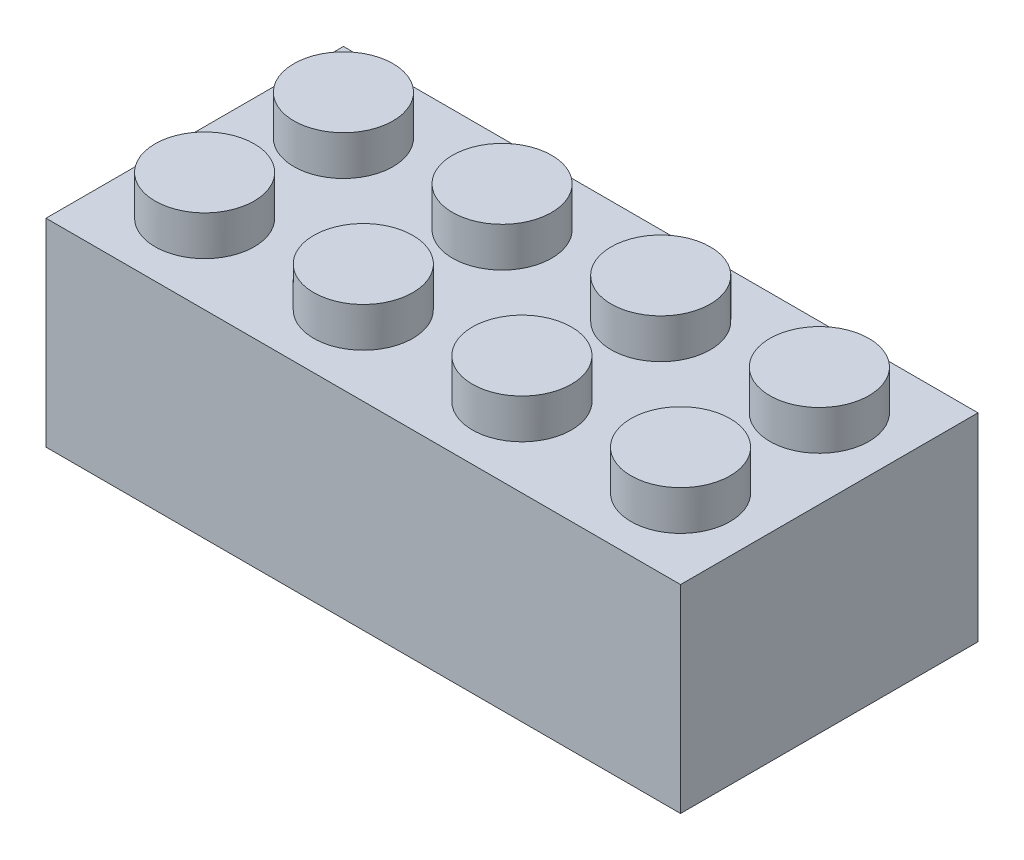
ISO-10303-21;
HEADER;
FILE_DESCRIPTION(('STEP AP214'),'2;1');
FILE_NAME('part.step','',(''),(''),'','','');
FILE_SCHEMA(('AUTOMOTIVE_DESIGN { 1 0 10303 214 1 1 1 1 }'));
ENDSEC;
DATA;
#1=APPLICATION_CONTEXT('core data for automotive mechanical design processes');
#2=APPLICATION_PROTOCOL_DEFINITION('international standard','automotive_design',2000,#1);
#3=PRODUCT_CONTEXT('',#1,'mechanical');
#4=PRODUCT('Part','Part','',(#3));
#5=PRODUCT_RELATED_PRODUCT_CATEGORY('part','',(#4));
#6=PRODUCT_DEFINITION_FORMATION('','',#4);
#7=PRODUCT_DEFINITION_CONTEXT('part definition',#1,'design');
#8=PRODUCT_DEFINITION('design','',#6,#7);
#9=PRODUCT_DEFINITION_SHAPE('','',#8);
#10=(LENGTH_UNIT() NAMED_UNIT(*) SI_UNIT(.MILLI.,.METRE.));
#11=(NAMED_UNIT(*) PLANE_ANGLE_UNIT() SI_UNIT($,.RADIAN.));
#12=(NAMED_UNIT(*) SI_UNIT($,.STERADIAN.) SOLID_ANGLE_UNIT());
#13=UNCERTAINTY_MEASURE_WITH_UNIT(LENGTH_MEASURE(1.E-05),#10,'distance_accuracy_value','');
#14=(GEOMETRIC_REPRESENTATION_CONTEXT(3) GLOBAL_UNCERTAINTY_ASSIGNED_CONTEXT((#13)) GLOBAL_UNIT_ASSIGNED_CONTEXT((#10,
#11,#12)) REPRESENTATION_CONTEXT('',''));
#15=CARTESIAN_POINT('',(0.,0.,0.));
#16=DIRECTION('',(0.,0.,1.));
#17=DIRECTION('',(1.,0.,0.));
#18=AXIS2_PLACEMENT_3D('',#15,#16,#17);
#19=CARTESIAN_POINT('',(0.,9.,0.));
#20=DIRECTION('',(0.,1.,0.));
#21=DIRECTION('',(0.,0.,1.));
#22=AXIS2_PLACEMENT_3D('',#19,#20,#21);
#23=PLANE('',#22);
#24=CARTESIAN_POINT('',(8.,9.,1.1172740284298E-13));
#25=DIRECTION('',(0.,1.,0.));
#26=DIRECTION('',(0.,0.,1.));
#27=AXIS2_PLACEMENT_3D('',#24,#25,#26);
#28=CIRCLE('',#27,3.5);
#29=CARTESIAN_POINT('',(8.,9.,3.50000000000011));
#30=VERTEX_POINT('',#29);
#31=EDGE_CURVE('E12',#30,#30,#28,.F.);
#32=ORIENTED_EDGE('',*,*,#31,.F.);
#33=EDGE_LOOP('',(#32));
#34=FACE_BOUND('',#33,.T.);
#35=DIRECTION('',(0.,0.,1.));
#36=VECTOR('',#35,1.);
#37=CARTESIAN_POINT('',(0.272235441119782,9.,-6.5));
#38=LINE('',#37,#36);
#39=CARTESIAN_POINT('',(0.272235441119782,9.,-6.5));
#40=VERTEX_POINT('',#39);
#41=CARTESIAN_POINT('',(0.272235441119782,9.,-3.48939649002493));
#42=VERTEX_POINT('',#41);
#43=EDGE_CURVE('E190',#40,#42,#38,.T.);
#44=ORIENTED_EDGE('',*,*,#43,.F.);
#45=DIRECTION('',(1.,0.,0.));
#46=VECTOR('',#45,1.);
#47=CARTESIAN_POINT('',(-15.,9.,-6.5));
#48=LINE('',#47,#46);
#49=CARTESIAN_POINT('',(15.,9.,-6.5));
#50=VERTEX_POINT('',#49);
#51=EDGE_CURVE('E207',#40,#50,#48,.T.);
#52=ORIENTED_EDGE('',*,*,#51,.T.);
#53=DIRECTION('',(0.,0.,1.));
#54=VECTOR('',#53,1.);
#55=CARTESIAN_POINT('',(15.,9.,-6.5));
#56=LINE('',#55,#54);
#57=CARTESIAN_POINT('',(15.,9.,6.5));
#58=VERTEX_POINT('',#57);
#59=EDGE_CURVE('E227',#50,#58,#56,.T.);
#60=ORIENTED_EDGE('',*,*,#59,.T.);
#61=DIRECTION('',(-1.,0.,0.));
#62=VECTOR('',#61,1.);
#63=CARTESIAN_POINT('',(-15.,9.,6.5));
#64=LINE('',#63,#62);
#65=CARTESIAN_POINT('',(0.272235441119782,9.,6.5));
#66=VERTEX_POINT('',#65);
#67=EDGE_CURVE('E330',#58,#66,#64,.T.);
#68=ORIENTED_EDGE('',*,*,#67,.T.);
#69=DIRECTION('',(0.,0.,1.));
#70=VECTOR('',#69,1.);
#71=CARTESIAN_POINT('',(0.272235441119782,9.,3.48939649002493));
#72=LINE('',#71,#70);
#73=CARTESIAN_POINT('',(0.272235441119782,9.,3.48939649002493));
#74=VERTEX_POINT('',#73);
#75=EDGE_CURVE('E327',#74,#66,#72,.T.);
#76=ORIENTED_EDGE('',*,*,#75,.F.);
#77=CARTESIAN_POINT('',(0.,9.,0.));
#78=DIRECTION('',(0.,1.,0.));
#79=DIRECTION('',(0.,0.,1.));
#80=AXIS2_PLACEMENT_3D('',#77,#78,#79);
#81=CIRCLE('',#80,3.5);
#82=EDGE_CURVE('E313',#42,#74,#81,.F.);
#83=ORIENTED_EDGE('',*,*,#82,.F.);
#84=EDGE_LOOP('',(#44,#52,#60,#68,#76,#83));
#85=FACE_BOUND('',#84,.T.);
#86=ADVANCED_FACE('F63',(#34,#85),#23,.F.);
#87=CARTESIAN_POINT('',(16.,10.,7.5));
#88=DIRECTION('',(-1.,0.,0.));
#89=DIRECTION('',(0.,0.,1.));
#90=AXIS2_PLACEMENT_3D('',#87,#88,#89);
#91=PLANE('',#90);
#92=DIRECTION('',(0.,0.,-1.));
#93=VECTOR('',#92,1.);
#94=CARTESIAN_POINT('',(16.,0.,7.5));
#95=LINE('',#94,#93);
#96=CARTESIAN_POINT('',(16.,0.,7.5));
#97=VERTEX_POINT('',#96);
#98=CARTESIAN_POINT('',(16.,0.,-7.5));
#99=VERTEX_POINT('',#98);
#100=EDGE_CURVE('E257',#97,#99,#95,.T.);
#101=ORIENTED_EDGE('',*,*,#100,.T.);
#102=DIRECTION('',(0.,-1.,0.));
#103=VECTOR('',#102,1.);
#104=CARTESIAN_POINT('',(16.,10.,-7.5));
#105=LINE('',#104,#103);
#106=CARTESIAN_POINT('',(16.,10.,-7.5));
#107=VERTEX_POINT('',#106);
#108=EDGE_CURVE('E284',#107,#99,#105,.T.);
#109=ORIENTED_EDGE('',*,*,#108,.F.);
#110=DIRECTION('',(0.,0.,-1.));
#111=VECTOR('',#110,1.);
#112=CARTESIAN_POINT('',(16.,10.,7.5));
#113=LINE('',#112,#111);
#114=CARTESIAN_POINT('',(16.,10.,7.5));
#115=VERTEX_POINT('',#114);
#116=EDGE_CURVE('E258',#115,#107,#113,.T.);
#117=ORIENTED_EDGE('',*,*,#116,.F.);
#118=DIRECTION('',(0.,-1.,0.));
#119=VECTOR('',#118,1.);
#120=CARTESIAN_POINT('',(16.,10.,7.5));
#121=LINE('',#120,#119);
#122=EDGE_CURVE('E268',#115,#97,#121,.T.);
#123=ORIENTED_EDGE('',*,*,#122,.T.);
#124=EDGE_LOOP('',(#101,#109,#117,#123));
#125=FACE_BOUND('',#124,.T.);
#126=ADVANCED_FACE('F65',(#125),#91,.F.);
#127=CARTESIAN_POINT('',(-16.,10.,-7.5));
#128=DIRECTION('',(0.,0.,1.));
#129=DIRECTION('',(1.,0.,0.));
#130=AXIS2_PLACEMENT_3D('',#127,#128,#129);
#131=PLANE('',#130);
#132=DIRECTION('',(-1.,0.,0.));
#133=VECTOR('',#132,1.);
#134=CARTESIAN_POINT('',(-16.,0.,-7.5));
#135=LINE('',#134,#133);
#136=CARTESIAN_POINT('',(-16.,0.,-7.5));
#137=VERTEX_POINT('',#136);
#138=EDGE_CURVE('E271',#99,#137,#135,.T.);
#139=ORIENTED_EDGE('',*,*,#138,.T.);
#140=DIRECTION('',(0.,-1.,0.));
#141=VECTOR('',#140,1.);
#142=CARTESIAN_POINT('',(-16.,10.,-7.5));
#143=LINE('',#142,#141);
#144=CARTESIAN_POINT('',(-16.,10.,-7.5));
#145=VERTEX_POINT('',#144);
#146=EDGE_CURVE('E281',#145,#137,#143,.T.);
#147=ORIENTED_EDGE('',*,*,#146,.F.);
#148=DIRECTION('',(-1.,0.,0.));
#149=VECTOR('',#148,1.);
#150=CARTESIAN_POINT('',(-16.,10.,-7.5));
#151=LINE('',#150,#149);
#152=EDGE_CURVE('E261',#107,#145,#151,.T.);
#153=ORIENTED_EDGE('',*,*,#152,.F.);
#154=ORIENTED_EDGE('',*,*,#108,.T.);
#155=EDGE_LOOP('',(#139,#147,#153,#154));
#156=FACE_BOUND('',#155,.T.);
#157=ADVANCED_FACE('F435',(#156),#131,.F.);
#158=CARTESIAN_POINT('',(-16.,10.,7.5));
#159=DIRECTION('',(1.,0.,0.));
#160=DIRECTION('',(0.,0.,-1.));
#161=AXIS2_PLACEMENT_3D('',#158,#159,#160);
#162=PLANE('',#161);
#163=DIRECTION('',(0.,0.,1.));
#164=VECTOR('',#163,1.);
#165=CARTESIAN_POINT('',(-16.,0.,7.5));
#166=LINE('',#165,#164);
#167=CARTESIAN_POINT('',(-16.,0.,7.5));
#168=VERTEX_POINT('',#167);
#169=EDGE_CURVE('E273',#137,#168,#166,.T.);
#170=ORIENTED_EDGE('',*,*,#169,.T.);
#171=DIRECTION('',(0.,-1.,0.));
#172=VECTOR('',#171,1.);
#173=CARTESIAN_POINT('',(-16.,10.,7.5));
#174=LINE('',#173,#172);
#175=CARTESIAN_POINT('',(-16.,10.,7.5));
#176=VERTEX_POINT('',#175);
#177=EDGE_CURVE('E278',#176,#168,#174,.T.);
#178=ORIENTED_EDGE('',*,*,#177,.F.);
#179=DIRECTION('',(0.,0.,1.));
#180=VECTOR('',#179,1.);
#181=CARTESIAN_POINT('',(-16.,10.,7.5));
#182=LINE('',#181,#180);
#183=EDGE_CURVE('E264',#145,#176,#182,.T.);
#184=ORIENTED_EDGE('',*,*,#183,.F.);
#185=ORIENTED_EDGE('',*,*,#146,.T.);
#186=EDGE_LOOP('',(#170,#178,#184,#185));
#187=FACE_BOUND('',#186,.T.);
#188=ADVANCED_FACE('F806',(#187),#162,.F.);
#189=CARTESIAN_POINT('',(-16.,10.,7.5));
#190=DIRECTION('',(0.,0.,-1.));
#191=DIRECTION('',(-1.,0.,0.));
#192=AXIS2_PLACEMENT_3D('',#189,#190,#191);
#193=PLANE('',#192);
#194=DIRECTION('',(1.,0.,0.));
#195=VECTOR('',#194,1.);
#196=CARTESIAN_POINT('',(-16.,0.,7.5));
#197=LINE('',#196,#195);
#198=EDGE_CURVE('E262',#168,#97,#197,.T.);
#199=ORIENTED_EDGE('',*,*,#198,.T.);
#200=ORIENTED_EDGE('',*,*,#122,.F.);
#201=DIRECTION('',(1.,0.,0.));
#202=VECTOR('',#201,1.);
#203=CARTESIAN_POINT('',(-16.,10.,7.5));
#204=LINE('',#203,#202);
#205=EDGE_CURVE('E266',#176,#115,#204,.T.);
#206=ORIENTED_EDGE('',*,*,#205,.F.);
#207=ORIENTED_EDGE('',*,*,#177,.T.);
#208=EDGE_LOOP('',(#199,#200,#206,#207));
#209=FACE_BOUND('',#208,.T.);
#210=ADVANCED_FACE('F797',(#209),#193,.F.);
#211=CARTESIAN_POINT('',(0.,10.,0.));
#212=DIRECTION('',(0.,-1.,0.));
#213=DIRECTION('',(0.,0.,-1.));
#214=AXIS2_PLACEMENT_3D('',#211,#212,#213);
#215=PLANE('',#214);
#216=CARTESIAN_POINT('',(-12.,10.,-3.5));
#217=DIRECTION('',(0.,-1.,0.));
#218=DIRECTION('',(0.,0.,-1.));
#219=AXIS2_PLACEMENT_3D('',#216,#217,#218);
#220=CIRCLE('',#219,2.5);
#221=CARTESIAN_POINT('',(-12.,10.,-6.));
#222=VERTEX_POINT('',#221);
#223=EDGE_CURVE('E308',#222,#222,#220,.F.);
#224=ORIENTED_EDGE('',*,*,#223,.F.);
#225=EDGE_LOOP('',(#224));
#226=FACE_BOUND('',#225,.T.);
#227=CARTESIAN_POINT('',(-4.,10.,-3.5));
#228=DIRECTION('',(0.,-1.,0.));
#229=DIRECTION('',(0.,0.,-1.));
#230=AXIS2_PLACEMENT_3D('',#227,#228,#229);
#231=CIRCLE('',#230,2.5);
#232=CARTESIAN_POINT('',(-4.,10.,-6.));
#233=VERTEX_POINT('',#232);
#234=EDGE_CURVE('E305',#233,#233,#231,.F.);
#235=ORIENTED_EDGE('',*,*,#234,.F.);
#236=EDGE_LOOP('',(#235));
#237=FACE_BOUND('',#236,.T.);
#238=CARTESIAN_POINT('',(4.,10.,-3.5));
#239=DIRECTION('',(0.,-1.,0.));
#240=DIRECTION('',(0.,0.,-1.));
#241=AXIS2_PLACEMENT_3D('',#238,#239,#240);
#242=CIRCLE('',#241,2.5);
#243=CARTESIAN_POINT('',(4.,10.,-6.));
#244=VERTEX_POINT('',#243);
#245=EDGE_CURVE('E302',#244,#244,#242,.F.);
#246=ORIENTED_EDGE('',*,*,#245,.F.);
#247=EDGE_LOOP('',(#246));
#248=FACE_BOUND('',#247,.T.);
#249=CARTESIAN_POINT('',(12.,10.,-3.5));
#250=DIRECTION('',(0.,-1.,0.));
#251=DIRECTION('',(0.,0.,-1.));
#252=AXIS2_PLACEMENT_3D('',#249,#250,#251);
#253=CIRCLE('',#252,2.5);
#254=CARTESIAN_POINT('',(12.,10.,-6.));
#255=VERTEX_POINT('',#254);
#256=EDGE_CURVE('E299',#255,#255,#253,.F.);
#257=ORIENTED_EDGE('',*,*,#256,.F.);
#258=EDGE_LOOP('',(#257));
#259=FACE_BOUND('',#258,.T.);
#260=CARTESIAN_POINT('',(12.,10.,3.5));
#261=DIRECTION('',(0.,-1.,0.));
#262=DIRECTION('',(0.,0.,-1.));
#263=AXIS2_PLACEMENT_3D('',#260,#261,#262);
#264=CIRCLE('',#263,2.5);
#265=CARTESIAN_POINT('',(12.,10.,0.999999999999998));
#266=VERTEX_POINT('',#265);
#267=EDGE_CURVE('E296',#266,#266,#264,.F.);
#268=ORIENTED_EDGE('',*,*,#267,.F.);
#269=EDGE_LOOP('',(#268));
#270=FACE_BOUND('',#269,.T.);
#271=CARTESIAN_POINT('',(4.,10.,3.5));
#272=DIRECTION('',(0.,-1.,0.));
#273=DIRECTION('',(0.,0.,-1.));
#274=AXIS2_PLACEMENT_3D('',#271,#272,#273);
#275=CIRCLE('',#274,2.5);
#276=CARTESIAN_POINT('',(4.,10.,0.999999999999998));
#277=VERTEX_POINT('',#276);
#278=EDGE_CURVE('E293',#277,#277,#275,.F.);
#279=ORIENTED_EDGE('',*,*,#278,.F.);
#280=EDGE_LOOP('',(#279));
#281=FACE_BOUND('',#280,.T.);
#282=CARTESIAN_POINT('',(-4.,10.,3.5));
#283=DIRECTION('',(0.,-1.,0.));
#284=DIRECTION('',(0.,0.,-1.));
#285=AXIS2_PLACEMENT_3D('',#282,#283,#284);
#286=CIRCLE('',#285,2.5);
#287=CARTESIAN_POINT('',(-4.,10.,0.999999999999998));
#288=VERTEX_POINT('',#287);
#289=EDGE_CURVE('E290',#288,#288,#286,.F.);
#290=ORIENTED_EDGE('',*,*,#289,.F.);
#291=EDGE_LOOP('',(#290));
#292=FACE_BOUND('',#291,.T.);
#293=CARTESIAN_POINT('',(-12.,10.,3.5));
#294=DIRECTION('',(0.,-1.,0.));
#295=DIRECTION('',(0.,0.,-1.));
#296=AXIS2_PLACEMENT_3D('',#293,#294,#295);
#297=CIRCLE('',#296,2.5);
#298=CARTESIAN_POINT('',(-12.,10.,0.999999999999998));
#299=VERTEX_POINT('',#298);
#300=EDGE_CURVE('E287',#299,#299,#297,.F.);
#301=ORIENTED_EDGE('',*,*,#300,.F.);
#302=EDGE_LOOP('',(#301));
#303=FACE_BOUND('',#302,.T.);
#304=ORIENTED_EDGE('',*,*,#116,.T.);
#305=ORIENTED_EDGE('',*,*,#152,.T.);
#306=ORIENTED_EDGE('',*,*,#183,.T.);
#307=ORIENTED_EDGE('',*,*,#205,.T.);
#308=EDGE_LOOP('',(#304,#305,#306,#307));
#309=FACE_BOUND('',#308,.T.);
#310=ADVANCED_FACE('F789',(#226,#237,#248,#259,#270,#281,#292,#303,#309),#215,.F.);
#311=CARTESIAN_POINT('',(0.,0.,0.));
#312=DIRECTION('',(0.,-1.,0.));
#313=DIRECTION('',(0.,0.,-1.));
#314=AXIS2_PLACEMENT_3D('',#311,#312,#313);
#315=PLANE('',#314);
#316=DIRECTION('',(0.,0.,1.));
#317=VECTOR('',#316,1.);
#318=CARTESIAN_POINT('',(15.,0.,-6.5));
#319=LINE('',#318,#317);
#320=CARTESIAN_POINT('',(15.,0.,-6.5));
#321=VERTEX_POINT('',#320);
#322=CARTESIAN_POINT('',(15.,0.,6.5));
#323=VERTEX_POINT('',#322);
#324=EDGE_CURVE('E215',#321,#323,#319,.T.);
#325=ORIENTED_EDGE('',*,*,#324,.F.);
#326=DIRECTION('',(1.,0.,0.));
#327=VECTOR('',#326,1.);
#328=CARTESIAN_POINT('',(-15.,0.,-6.5));
#329=LINE('',#328,#327);
#330=CARTESIAN_POINT('',(-15.,0.,-6.5));
#331=VERTEX_POINT('',#330);
#332=EDGE_CURVE('E224',#331,#321,#329,.T.);
#333=ORIENTED_EDGE('',*,*,#332,.F.);
#334=DIRECTION('',(0.,0.,-1.));
#335=VECTOR('',#334,1.);
#336=CARTESIAN_POINT('',(-15.,0.,-6.5));
#337=LINE('',#336,#335);
#338=CARTESIAN_POINT('',(-15.,0.,6.5));
#339=VERTEX_POINT('',#338);
#340=EDGE_CURVE('E221',#339,#331,#337,.T.);
#341=ORIENTED_EDGE('',*,*,#340,.F.);
#342=DIRECTION('',(-1.,0.,0.));
#343=VECTOR('',#342,1.);
#344=CARTESIAN_POINT('',(-15.,0.,6.5));
#345=LINE('',#344,#343);
#346=EDGE_CURVE('E217',#323,#339,#345,.T.);
#347=ORIENTED_EDGE('',*,*,#346,.F.);
#348=EDGE_LOOP('',(#325,#333,#341,#347));
#349=FACE_BOUND('',#348,.T.);
#350=ORIENTED_EDGE('',*,*,#100,.F.);
#351=ORIENTED_EDGE('',*,*,#198,.F.);
#352=ORIENTED_EDGE('',*,*,#169,.F.);
#353=ORIENTED_EDGE('',*,*,#138,.F.);
#354=EDGE_LOOP('',(#350,#351,#352,#353));
#355=FACE_BOUND('',#354,.T.);
#356=ADVANCED_FACE('F387',(#349,#355),#315,.T.);
#357=CARTESIAN_POINT('',(-12.,12.,3.5));
#358=DIRECTION('',(0.,-1.,0.));
#359=DIRECTION('',(0.,0.,-1.));
#360=AXIS2_PLACEMENT_3D('',#357,#358,#359);
#361=CYLINDRICAL_SURFACE('',#360,2.5);
#362=CARTESIAN_POINT('',(-12.,12.,3.5));
#363=DIRECTION('',(0.,1.,0.));
#364=DIRECTION('',(0.,0.,1.));
#365=AXIS2_PLACEMENT_3D('',#362,#363,#364);
#366=CIRCLE('',#365,2.5);
#367=CARTESIAN_POINT('',(-12.,12.,6.));
#368=VERTEX_POINT('',#367);
#369=EDGE_CURVE('E254',#368,#368,#366,.T.);
#370=ORIENTED_EDGE('',*,*,#369,.F.);
#371=EDGE_LOOP('',(#370));
#372=FACE_BOUND('',#371,.T.);
#373=ORIENTED_EDGE('',*,*,#300,.T.);
#374=EDGE_LOOP('',(#373));
#375=FACE_BOUND('',#374,.T.);
#376=ADVANCED_FACE('F772',(#372,#375),#361,.T.);
#377=CARTESIAN_POINT('',(-12.,12.,3.5));
#378=DIRECTION('',(0.,1.,0.));
#379=DIRECTION('',(0.,0.,1.));
#380=AXIS2_PLACEMENT_3D('',#377,#378,#379);
#381=PLANE('',#380);
#382=ORIENTED_EDGE('',*,*,#369,.T.);
#383=EDGE_LOOP('',(#382));
#384=FACE_BOUND('',#383,.T.);
#385=ADVANCED_FACE('F763',(#384),#381,.T.);
#386=CARTESIAN_POINT('',(-4.,12.,3.5));
#387=DIRECTION('',(0.,-1.,0.));
#388=DIRECTION('',(0.,0.,-1.));
#389=AXIS2_PLACEMENT_3D('',#386,#387,#388);
#390=CYLINDRICAL_SURFACE('',#389,2.5);
#391=CARTESIAN_POINT('',(-4.,12.,3.5));
#392=DIRECTION('',(0.,1.,0.));
#393=DIRECTION('',(0.,0.,1.));
#394=AXIS2_PLACEMENT_3D('',#391,#392,#393);
#395=CIRCLE('',#394,2.5);
#396=CARTESIAN_POINT('',(-4.,12.,6.));
#397=VERTEX_POINT('',#396);
#398=EDGE_CURVE('E251',#397,#397,#395,.T.);
#399=ORIENTED_EDGE('',*,*,#398,.F.);
#400=EDGE_LOOP('',(#399));
#401=FACE_BOUND('',#400,.T.);
#402=ORIENTED_EDGE('',*,*,#289,.T.);
#403=EDGE_LOOP('',(#402));
#404=FACE_BOUND('',#403,.T.);
#405=ADVANCED_FACE('F754',(#401,#404),#390,.T.);
#406=CARTESIAN_POINT('',(-4.,12.,3.5));
#407=DIRECTION('',(0.,1.,0.));
#408=DIRECTION('',(0.,0.,1.));
#409=AXIS2_PLACEMENT_3D('',#406,#407,#408);
#410=PLANE('',#409);
#411=ORIENTED_EDGE('',*,*,#398,.T.);
#412=EDGE_LOOP('',(#411));
#413=FACE_BOUND('',#412,.T.);
#414=ADVANCED_FACE('F745',(#413),#410,.T.);
#415=CARTESIAN_POINT('',(4.,12.,3.5));
#416=DIRECTION('',(0.,-1.,0.));
#417=DIRECTION('',(0.,0.,-1.));
#418=AXIS2_PLACEMENT_3D('',#415,#416,#417);
#419=CYLINDRICAL_SURFACE('',#418,2.5);
#420=CARTESIAN_POINT('',(4.,12.,3.5));
#421=DIRECTION('',(0.,1.,0.));
#422=DIRECTION('',(0.,0.,1.));
#423=AXIS2_PLACEMENT_3D('',#420,#421,#422);
#424=CIRCLE('',#423,2.5);
#425=CARTESIAN_POINT('',(4.,12.,6.));
#426=VERTEX_POINT('',#425);
#427=EDGE_CURVE('E248',#426,#426,#424,.T.);
#428=ORIENTED_EDGE('',*,*,#427,.F.);
#429=EDGE_LOOP('',(#428));
#430=FACE_BOUND('',#429,.T.);
#431=ORIENTED_EDGE('',*,*,#278,.T.);
#432=EDGE_LOOP('',(#431));
#433=FACE_BOUND('',#432,.T.);
#434=ADVANCED_FACE('F736',(#430,#433),#419,.T.);
#435=CARTESIAN_POINT('',(4.,12.,3.5));
#436=DIRECTION('',(0.,1.,0.));
#437=DIRECTION('',(0.,0.,1.));
#438=AXIS2_PLACEMENT_3D('',#435,#436,#437);
#439=PLANE('',#438);
#440=ORIENTED_EDGE('',*,*,#427,.T.);
#441=EDGE_LOOP('',(#440));
#442=FACE_BOUND('',#441,.T.);
#443=ADVANCED_FACE('F727',(#442),#439,.T.);
#444=CARTESIAN_POINT('',(12.,12.,3.5));
#445=DIRECTION('',(0.,-1.,0.));
#446=DIRECTION('',(0.,0.,-1.));
#447=AXIS2_PLACEMENT_3D('',#444,#445,#446);
#448=CYLINDRICAL_SURFACE('',#447,2.5);
#449=CARTESIAN_POINT('',(12.,12.,3.5));
#450=DIRECTION('',(0.,1.,0.));
#451=DIRECTION('',(0.,0.,1.));
#452=AXIS2_PLACEMENT_3D('',#449,#450,#451);
#453=CIRCLE('',#452,2.5);
#454=CARTESIAN_POINT('',(12.,12.,6.));
#455=VERTEX_POINT('',#454);
#456=EDGE_CURVE('E245',#455,#455,#453,.T.);
#457=ORIENTED_EDGE('',*,*,#456,.F.);
#458=EDGE_LOOP('',(#457));
#459=FACE_BOUND('',#458,.T.);
#460=ORIENTED_EDGE('',*,*,#267,.T.);
#461=EDGE_LOOP('',(#460));
#462=FACE_BOUND('',#461,.T.);
#463=ADVANCED_FACE('F718',(#459,#462),#448,.T.);
#464=CARTESIAN_POINT('',(12.,12.,3.5));
#465=DIRECTION('',(0.,1.,0.));
#466=DIRECTION('',(0.,0.,1.));
#467=AXIS2_PLACEMENT_3D('',#464,#465,#466);
#468=PLANE('',#467);
#469=ORIENTED_EDGE('',*,*,#456,.T.);
#470=EDGE_LOOP('',(#469));
#471=FACE_BOUND('',#470,.T.);
#472=ADVANCED_FACE('F709',(#471),#468,.T.);
#473=CARTESIAN_POINT('',(12.,12.,-3.5));
#474=DIRECTION('',(0.,-1.,0.));
#475=DIRECTION('',(0.,0.,-1.));
#476=AXIS2_PLACEMENT_3D('',#473,#474,#475);
#477=CYLINDRICAL_SURFACE('',#476,2.5);
#478=CARTESIAN_POINT('',(12.,12.,-3.5));
#479=DIRECTION('',(0.,1.,0.));
#480=DIRECTION('',(0.,0.,-1.));
#481=AXIS2_PLACEMENT_3D('',#478,#479,#480);
#482=CIRCLE('',#481,2.5);
#483=CARTESIAN_POINT('',(12.,12.,-6.));
#484=VERTEX_POINT('',#483);
#485=EDGE_CURVE('E242',#484,#484,#482,.T.);
#486=ORIENTED_EDGE('',*,*,#485,.F.);
#487=EDGE_LOOP('',(#486));
#488=FACE_BOUND('',#487,.T.);
#489=ORIENTED_EDGE('',*,*,#256,.T.);
#490=EDGE_LOOP('',(#489));
#491=FACE_BOUND('',#490,.T.);
#492=ADVANCED_FACE('F700',(#488,#491),#477,.T.);
#493=CARTESIAN_POINT('',(12.,12.,-3.5));
#494=DIRECTION('',(0.,-1.,0.));
#495=DIRECTION('',(0.,0.,-1.));
#496=AXIS2_PLACEMENT_3D('',#493,#494,#495);
#497=PLANE('',#496);
#498=ORIENTED_EDGE('',*,*,#485,.T.);
#499=EDGE_LOOP('',(#498));
#500=FACE_BOUND('',#499,.T.);
#501=ADVANCED_FACE('F691',(#500),#497,.F.);
#502=CARTESIAN_POINT('',(4.,12.,-3.5));
#503=DIRECTION('',(0.,-1.,0.));
#504=DIRECTION('',(0.,0.,-1.));
#505=AXIS2_PLACEMENT_3D('',#502,#503,#504);
#506=CYLINDRICAL_SURFACE('',#505,2.5);
#507=CARTESIAN_POINT('',(4.,12.,-3.5));
#508=DIRECTION('',(0.,1.,0.));
#509=DIRECTION('',(0.,0.,-1.));
#510=AXIS2_PLACEMENT_3D('',#507,#508,#509);
#511=CIRCLE('',#510,2.5);
#512=CARTESIAN_POINT('',(4.,12.,-6.));
#513=VERTEX_POINT('',#512);
#514=EDGE_CURVE('E239',#513,#513,#511,.T.);
#515=ORIENTED_EDGE('',*,*,#514,.F.);
#516=EDGE_LOOP('',(#515));
#517=FACE_BOUND('',#516,.T.);
#518=ORIENTED_EDGE('',*,*,#245,.T.);
#519=EDGE_LOOP('',(#518));
#520=FACE_BOUND('',#519,.T.);
#521=ADVANCED_FACE('F682',(#517,#520),#506,.T.);
#522=CARTESIAN_POINT('',(4.,12.,-3.5));
#523=DIRECTION('',(0.,-1.,0.));
#524=DIRECTION('',(0.,0.,-1.));
#525=AXIS2_PLACEMENT_3D('',#522,#523,#524);
#526=PLANE('',#525);
#527=ORIENTED_EDGE('',*,*,#514,.T.);
#528=EDGE_LOOP('',(#527));
#529=FACE_BOUND('',#528,.T.);
#530=ADVANCED_FACE('F673',(#529),#526,.F.);
#531=CARTESIAN_POINT('',(-4.,12.,-3.5));
#532=DIRECTION('',(0.,-1.,0.));
#533=DIRECTION('',(0.,0.,-1.));
#534=AXIS2_PLACEMENT_3D('',#531,#532,#533);
#535=CYLINDRICAL_SURFACE('',#534,2.5);
#536=CARTESIAN_POINT('',(-4.,12.,-3.5));
#537=DIRECTION('',(0.,1.,0.));
#538=DIRECTION('',(0.,0.,-1.));
#539=AXIS2_PLACEMENT_3D('',#536,#537,#538);
#540=CIRCLE('',#539,2.5);
#541=CARTESIAN_POINT('',(-4.,12.,-6.));
#542=VERTEX_POINT('',#541);
#543=EDGE_CURVE('E236',#542,#542,#540,.T.);
#544=ORIENTED_EDGE('',*,*,#543,.F.);
#545=EDGE_LOOP('',(#544));
#546=FACE_BOUND('',#545,.T.);
#547=ORIENTED_EDGE('',*,*,#234,.T.);
#548=EDGE_LOOP('',(#547));
#549=FACE_BOUND('',#548,.T.);
#550=ADVANCED_FACE('F664',(#546,#549),#535,.T.);
#551=CARTESIAN_POINT('',(-4.,12.,-3.5));
#552=DIRECTION('',(0.,-1.,0.));
#553=DIRECTION('',(0.,0.,-1.));
#554=AXIS2_PLACEMENT_3D('',#551,#552,#553);
#555=PLANE('',#554);
#556=ORIENTED_EDGE('',*,*,#543,.T.);
#557=EDGE_LOOP('',(#556));
#558=FACE_BOUND('',#557,.T.);
#559=ADVANCED_FACE('F655',(#558),#555,.F.);
#560=CARTESIAN_POINT('',(-12.,12.,-3.5));
#561=DIRECTION('',(0.,-1.,0.));
#562=DIRECTION('',(0.,0.,-1.));
#563=AXIS2_PLACEMENT_3D('',#560,#561,#562);
#564=CYLINDRICAL_SURFACE('',#563,2.5);
#565=CARTESIAN_POINT('',(-12.,12.,-3.5));
#566=DIRECTION('',(0.,1.,0.));
#567=DIRECTION('',(0.,0.,-1.));
#568=AXIS2_PLACEMENT_3D('',#565,#566,#567);
#569=CIRCLE('',#568,2.5);
#570=CARTESIAN_POINT('',(-12.,12.,-6.));
#571=VERTEX_POINT('',#570);
#572=EDGE_CURVE('E230',#571,#571,#569,.T.);
#573=ORIENTED_EDGE('',*,*,#572,.F.);
#574=EDGE_LOOP('',(#573));
#575=FACE_BOUND('',#574,.T.);
#576=ORIENTED_EDGE('',*,*,#223,.T.);
#577=EDGE_LOOP('',(#576));
#578=FACE_BOUND('',#577,.T.);
#579=ADVANCED_FACE('F646',(#575,#578),#564,.T.);
#580=CARTESIAN_POINT('',(-12.,12.,-3.5));
#581=DIRECTION('',(0.,-1.,0.));
#582=DIRECTION('',(0.,0.,-1.));
#583=AXIS2_PLACEMENT_3D('',#580,#581,#582);
#584=PLANE('',#583);
#585=ORIENTED_EDGE('',*,*,#572,.T.);
#586=EDGE_LOOP('',(#585));
#587=FACE_BOUND('',#586,.T.);
#588=ADVANCED_FACE('F638',(#587),#584,.F.);
#589=CARTESIAN_POINT('',(15.,9.,-6.5));
#590=DIRECTION('',(1.,0.,0.));
#591=DIRECTION('',(0.,0.,-1.));
#592=AXIS2_PLACEMENT_3D('',#589,#590,#591);
#593=PLANE('',#592);
#594=ORIENTED_EDGE('',*,*,#324,.T.);
#595=DIRECTION('',(0.,-1.,0.));
#596=VECTOR('',#595,1.);
#597=CARTESIAN_POINT('',(15.,9.,6.5));
#598=LINE('',#597,#596);
#599=EDGE_CURVE('E206',#58,#323,#598,.T.);
#600=ORIENTED_EDGE('',*,*,#599,.F.);
#601=ORIENTED_EDGE('',*,*,#59,.F.);
#602=DIRECTION('',(0.,-1.,0.));
#603=VECTOR('',#602,1.);
#604=CARTESIAN_POINT('',(15.,9.,-6.5));
#605=LINE('',#604,#603);
#606=EDGE_CURVE('E228',#50,#321,#605,.T.);
#607=ORIENTED_EDGE('',*,*,#606,.T.);
#608=EDGE_LOOP('',(#594,#600,#601,#607));
#609=FACE_BOUND('',#608,.T.);
#610=ADVANCED_FACE('F390',(#609),#593,.F.);
#611=CARTESIAN_POINT('',(-15.,9.,-6.5));
#612=DIRECTION('',(0.,0.,-1.));
#613=DIRECTION('',(-1.,0.,0.));
#614=AXIS2_PLACEMENT_3D('',#611,#612,#613);
#615=PLANE('',#614);
#616=DIRECTION('',(1.,0.,0.));
#617=VECTOR('',#616,1.);
#618=CARTESIAN_POINT('',(-0.272235441119782,2.,-6.5));
#619=LINE('',#618,#617);
#620=CARTESIAN_POINT('',(-0.272235441119782,2.,-6.5));
#621=VERTEX_POINT('',#620);
#622=CARTESIAN_POINT('',(0.272235441119782,2.,-6.5));
#623=VERTEX_POINT('',#622);
#624=EDGE_CURVE('E198',#621,#623,#619,.T.);
#625=ORIENTED_EDGE('',*,*,#624,.F.);
#626=DIRECTION('',(0.,1.,0.));
#627=VECTOR('',#626,1.);
#628=CARTESIAN_POINT('',(-0.272235441119782,2.,-6.5));
#629=LINE('',#628,#627);
#630=CARTESIAN_POINT('',(-0.272235441119782,9.,-6.5));
#631=VERTEX_POINT('',#630);
#632=EDGE_CURVE('E181',#621,#631,#629,.T.);
#633=ORIENTED_EDGE('',*,*,#632,.T.);
#634=CARTESIAN_POINT('',(-15.,9.,-6.5));
#635=VERTEX_POINT('',#634);
#636=EDGE_CURVE('E196',#635,#631,#48,.T.);
#637=ORIENTED_EDGE('',*,*,#636,.F.);
#638=DIRECTION('',(0.,-1.,0.));
#639=VECTOR('',#638,1.);
#640=CARTESIAN_POINT('',(-15.,9.,-6.5));
#641=LINE('',#640,#639);
#642=EDGE_CURVE('E231',#635,#331,#641,.T.);
#643=ORIENTED_EDGE('',*,*,#642,.T.);
#644=ORIENTED_EDGE('',*,*,#332,.T.);
#645=ORIENTED_EDGE('',*,*,#606,.F.);
#646=ORIENTED_EDGE('',*,*,#51,.F.);
#647=DIRECTION('',(0.,1.,0.));
#648=VECTOR('',#647,1.);
#649=CARTESIAN_POINT('',(0.272235441119782,2.,-6.5));
#650=LINE('',#649,#648);
#651=EDGE_CURVE('E199',#623,#40,#650,.T.);
#652=ORIENTED_EDGE('',*,*,#651,.F.);
#653=EDGE_LOOP('',(#625,#633,#637,#643,#644,#645,#646,#652));
#654=FACE_BOUND('',#653,.T.);
#655=ADVANCED_FACE('F195',(#654),#615,.F.);
#656=CARTESIAN_POINT('',(-15.,9.,-6.5));
#657=DIRECTION('',(-1.,0.,0.));
#658=DIRECTION('',(0.,0.,1.));
#659=AXIS2_PLACEMENT_3D('',#656,#657,#658);
#660=PLANE('',#659);
#661=ORIENTED_EDGE('',*,*,#340,.T.);
#662=ORIENTED_EDGE('',*,*,#642,.F.);
#663=DIRECTION('',(0.,0.,-1.));
#664=VECTOR('',#663,1.);
#665=CARTESIAN_POINT('',(-15.,9.,-6.5));
#666=LINE('',#665,#664);
#667=CARTESIAN_POINT('',(-15.,9.,6.5));
#668=VERTEX_POINT('',#667);
#669=EDGE_CURVE('E205',#668,#635,#666,.T.);
#670=ORIENTED_EDGE('',*,*,#669,.F.);
#671=DIRECTION('',(0.,-1.,0.));
#672=VECTOR('',#671,1.);
#673=CARTESIAN_POINT('',(-15.,9.,6.5));
#674=LINE('',#673,#672);
#675=EDGE_CURVE('E210',#668,#339,#674,.T.);
#676=ORIENTED_EDGE('',*,*,#675,.T.);
#677=EDGE_LOOP('',(#661,#662,#670,#676));
#678=FACE_BOUND('',#677,.T.);
#679=ADVANCED_FACE('F380',(#678),#660,.F.);
#680=CARTESIAN_POINT('',(-15.,9.,6.5));
#681=DIRECTION('',(0.,0.,1.));
#682=DIRECTION('',(1.,0.,0.));
#683=AXIS2_PLACEMENT_3D('',#680,#681,#682);
#684=PLANE('',#683);
#685=CARTESIAN_POINT('',(-0.272235441119782,9.,6.5));
#686=VERTEX_POINT('',#685);
#687=EDGE_CURVE('E373',#686,#668,#64,.T.);
#688=ORIENTED_EDGE('',*,*,#687,.F.);
#689=DIRECTION('',(0.,1.,0.));
#690=VECTOR('',#689,1.);
#691=CARTESIAN_POINT('',(-0.272235441119782,2.,6.5));
#692=LINE('',#691,#690);
#693=CARTESIAN_POINT('',(-0.272235441119784,2.,6.5));
#694=VERTEX_POINT('',#693);
#695=EDGE_CURVE('E86',#694,#686,#692,.T.);
#696=ORIENTED_EDGE('',*,*,#695,.F.);
#697=DIRECTION('',(1.,0.,0.));
#698=VECTOR('',#697,1.);
#699=CARTESIAN_POINT('',(-0.272235441119782,2.,6.5));
#700=LINE('',#699,#698);
#701=CARTESIAN_POINT('',(0.272235441119782,2.,6.5));
#702=VERTEX_POINT('',#701);
#703=EDGE_CURVE('E405',#694,#702,#700,.T.);
#704=ORIENTED_EDGE('',*,*,#703,.T.);
#705=DIRECTION('',(0.,1.,0.));
#706=VECTOR('',#705,1.);
#707=CARTESIAN_POINT('',(0.272235441119782,2.,6.5));
#708=LINE('',#707,#706);
#709=EDGE_CURVE('E340',#702,#66,#708,.T.);
#710=ORIENTED_EDGE('',*,*,#709,.T.);
#711=ORIENTED_EDGE('',*,*,#67,.F.);
#712=ORIENTED_EDGE('',*,*,#599,.T.);
#713=ORIENTED_EDGE('',*,*,#346,.T.);
#714=ORIENTED_EDGE('',*,*,#675,.F.);
#715=EDGE_LOOP('',(#688,#696,#704,#710,#711,#712,#713,#714));
#716=FACE_BOUND('',#715,.T.);
#717=ADVANCED_FACE('F376',(#716),#684,.F.);
#718=ORIENTED_EDGE('',*,*,#636,.T.);
#719=DIRECTION('',(0.,0.,1.));
#720=VECTOR('',#719,1.);
#721=CARTESIAN_POINT('',(-0.272235441119782,9.,-6.5));
#722=LINE('',#721,#720);
#723=CARTESIAN_POINT('',(-0.272235441119782,9.,-3.48939649002493));
#724=VERTEX_POINT('',#723);
#725=EDGE_CURVE('E177',#631,#724,#722,.T.);
#726=ORIENTED_EDGE('',*,*,#725,.T.);
#727=CARTESIAN_POINT('',(-0.272235441119782,9.,3.48939649002493));
#728=VERTEX_POINT('',#727);
#729=EDGE_CURVE('E71',#728,#724,#81,.F.);
#730=ORIENTED_EDGE('',*,*,#729,.F.);
#731=DIRECTION('',(0.,0.,1.));
#732=VECTOR('',#731,1.);
#733=CARTESIAN_POINT('',(-0.272235441119782,9.,3.48939649002493));
#734=LINE('',#733,#732);
#735=EDGE_CURVE('E189',#728,#686,#734,.T.);
#736=ORIENTED_EDGE('',*,*,#735,.T.);
#737=ORIENTED_EDGE('',*,*,#687,.T.);
#738=ORIENTED_EDGE('',*,*,#669,.T.);
#739=EDGE_LOOP('',(#718,#726,#730,#736,#737,#738));
#740=FACE_BOUND('',#739,.T.);
#741=CARTESIAN_POINT('',(-8.,9.,0.));
#742=DIRECTION('',(0.,1.,0.));
#743=DIRECTION('',(0.,0.,1.));
#744=AXIS2_PLACEMENT_3D('',#741,#742,#743);
#745=CIRCLE('',#744,3.5);
#746=CARTESIAN_POINT('',(-8.,9.,3.5));
#747=VERTEX_POINT('',#746);
#748=EDGE_CURVE('E311',#747,#747,#745,.F.);
#749=ORIENTED_EDGE('',*,*,#748,.F.);
#750=EDGE_LOOP('',(#749));
#751=FACE_BOUND('',#750,.T.);
#752=ADVANCED_FACE('F202',(#740,#751),#23,.F.);
#753=CARTESIAN_POINT('',(-8.,-9.89949493661167,0.));
#754=DIRECTION('',(0.,1.,0.));
#755=DIRECTION('',(0.,0.,1.));
#756=AXIS2_PLACEMENT_3D('',#753,#754,#755);
#757=CYLINDRICAL_SURFACE('',#756,3.5);
#758=ORIENTED_EDGE('',*,*,#748,.T.);
#759=EDGE_LOOP('',(#758));
#760=FACE_BOUND('',#759,.T.);
#761=CARTESIAN_POINT('',(-8.,0.,0.));
#762=DIRECTION('',(0.,-1.,0.));
#763=DIRECTION('',(0.,0.,-1.));
#764=AXIS2_PLACEMENT_3D('',#761,#762,#763);
#765=CIRCLE('',#764,3.5);
#766=CARTESIAN_POINT('',(-8.,0.,-3.5));
#767=VERTEX_POINT('',#766);
#768=EDGE_CURVE('E218',#767,#767,#765,.T.);
#769=ORIENTED_EDGE('',*,*,#768,.F.);
#770=EDGE_LOOP('',(#769));
#771=FACE_BOUND('',#770,.T.);
#772=ADVANCED_FACE('F441',(#760,#771),#757,.T.);
#773=CARTESIAN_POINT('',(-8.,-9.89949493661167,0.));
#774=DIRECTION('',(0.,1.,0.));
#775=DIRECTION('',(0.,0.,1.));
#776=AXIS2_PLACEMENT_3D('',#773,#774,#775);
#777=CYLINDRICAL_SURFACE('',#776,3.);
#778=CARTESIAN_POINT('',(-8.,9.,0.));
#779=DIRECTION('',(0.,-1.,0.));
#780=DIRECTION('',(0.,0.,-1.));
#781=AXIS2_PLACEMENT_3D('',#778,#779,#780);
#782=CIRCLE('',#781,3.);
#783=CARTESIAN_POINT('',(-8.,9.,-3.));
#784=VERTEX_POINT('',#783);
#785=EDGE_CURVE('E368',#784,#784,#782,.T.);
#786=ORIENTED_EDGE('',*,*,#785,.F.);
#787=EDGE_LOOP('',(#786));
#788=FACE_BOUND('',#787,.T.);
#789=CARTESIAN_POINT('',(-8.,0.,0.));
#790=DIRECTION('',(0.,-1.,0.));
#791=DIRECTION('',(0.,0.,-1.));
#792=AXIS2_PLACEMENT_3D('',#789,#790,#791);
#793=CIRCLE('',#792,3.);
#794=CARTESIAN_POINT('',(-8.,0.,-3.));
#795=VERTEX_POINT('',#794);
#796=EDGE_CURVE('E360',#795,#795,#793,.T.);
#797=ORIENTED_EDGE('',*,*,#796,.T.);
#798=EDGE_LOOP('',(#797));
#799=FACE_BOUND('',#798,.T.);
#800=ADVANCED_FACE('F447',(#788,#799),#777,.F.);
#801=CARTESIAN_POINT('',(0.,0.,0.));
#802=DIRECTION('',(0.,-1.,0.));
#803=DIRECTION('',(0.,0.,-1.));
#804=AXIS2_PLACEMENT_3D('',#801,#802,#803);
#805=PLANE('',#804);
#806=ORIENTED_EDGE('',*,*,#796,.F.);
#807=EDGE_LOOP('',(#806));
#808=FACE_BOUND('',#807,.T.);
#809=ORIENTED_EDGE('',*,*,#768,.T.);
#810=EDGE_LOOP('',(#809));
#811=FACE_BOUND('',#810,.T.);
#812=ADVANCED_FACE('F451',(#808,#811),#805,.T.);
#813=ORIENTED_EDGE('',*,*,#785,.T.);
#814=EDGE_LOOP('',(#813));
#815=FACE_BOUND('',#814,.T.);
#816=ADVANCED_FACE('F442',(#815),#23,.F.);
#817=CARTESIAN_POINT('',(0.,-9.89949493661167,0.));
#818=DIRECTION('',(0.,1.,0.));
#819=DIRECTION('',(0.,0.,1.));
#820=AXIS2_PLACEMENT_3D('',#817,#818,#819);
#821=CYLINDRICAL_SURFACE('',#820,3.5);
#822=ORIENTED_EDGE('',*,*,#729,.T.);
#823=DIRECTION('',(0.,1.,0.));
#824=VECTOR('',#823,1.);
#825=CARTESIAN_POINT('',(-0.272235441119782,2.,-3.48939649002493));
#826=LINE('',#825,#824);
#827=CARTESIAN_POINT('',(-0.272235441119782,2.,-3.48939649002493));
#828=VERTEX_POINT('',#827);
#829=EDGE_CURVE('E184',#828,#724,#826,.T.);
#830=ORIENTED_EDGE('',*,*,#829,.F.);
#831=CARTESIAN_POINT('',(0.,2.,8.17054757185076E-13));
#832=DIRECTION('',(0.,-1.,0.));
#833=DIRECTION('',(0.,0.,-1.));
#834=AXIS2_PLACEMENT_3D('',#831,#832,#833);
#835=CIRCLE('',#834,3.50000000000081);
#836=CARTESIAN_POINT('',(0.272235441119782,2.,-3.48939649002493));
#837=VERTEX_POINT('',#836);
#838=EDGE_CURVE('E400',#828,#837,#835,.T.);
#839=ORIENTED_EDGE('',*,*,#838,.T.);
#840=DIRECTION('',(0.,1.,0.));
#841=VECTOR('',#840,1.);
#842=CARTESIAN_POINT('',(0.272235441119782,2.,-3.48939649002493));
#843=LINE('',#842,#841);
#844=EDGE_CURVE('E78',#837,#42,#843,.T.);
#845=ORIENTED_EDGE('',*,*,#844,.T.);
#846=ORIENTED_EDGE('',*,*,#82,.T.);
#847=DIRECTION('',(0.,1.,0.));
#848=VECTOR('',#847,1.);
#849=CARTESIAN_POINT('',(0.272235441119782,2.,3.48939649002493));
#850=LINE('',#849,#848);
#851=CARTESIAN_POINT('',(0.272235441119782,2.,3.48939649002493));
#852=VERTEX_POINT('',#851);
#853=EDGE_CURVE('E320',#852,#74,#850,.T.);
#854=ORIENTED_EDGE('',*,*,#853,.F.);
#855=CARTESIAN_POINT('',(0.,2.,-1.97758476261356E-13));
#856=DIRECTION('',(0.,1.,0.));
#857=DIRECTION('',(0.,0.,1.));
#858=AXIS2_PLACEMENT_3D('',#855,#856,#857);
#859=CIRCLE('',#858,3.5000000000002);
#860=CARTESIAN_POINT('',(-0.272235441119782,2.,3.48939649002493));
#861=VERTEX_POINT('',#860);
#862=EDGE_CURVE('E347',#861,#852,#859,.T.);
#863=ORIENTED_EDGE('',*,*,#862,.F.);
#864=DIRECTION('',(0.,1.,0.));
#865=VECTOR('',#864,1.);
#866=CARTESIAN_POINT('',(-0.272235441119784,2.,3.48939649002493));
#867=LINE('',#866,#865);
#868=EDGE_CURVE('E339',#861,#728,#867,.T.);
#869=ORIENTED_EDGE('',*,*,#868,.T.);
#870=EDGE_LOOP('',(#822,#830,#839,#845,#846,#854,#863,#869));
#871=FACE_BOUND('',#870,.T.);
#872=CARTESIAN_POINT('',(0.,0.,0.));
#873=DIRECTION('',(0.,-1.,0.));
#874=DIRECTION('',(0.,0.,-1.));
#875=AXIS2_PLACEMENT_3D('',#872,#873,#874);
#876=CIRCLE('',#875,3.5);
#877=CARTESIAN_POINT('',(0.,0.,-3.5));
#878=VERTEX_POINT('',#877);
#879=EDGE_CURVE('E351',#878,#878,#876,.T.);
#880=ORIENTED_EDGE('',*,*,#879,.F.);
#881=EDGE_LOOP('',(#880));
#882=FACE_BOUND('',#881,.T.);
#883=ADVANCED_FACE('F317',(#871,#882),#821,.T.);
#884=CARTESIAN_POINT('',(0.,-9.89949493661167,0.));
#885=DIRECTION('',(0.,1.,0.));
#886=DIRECTION('',(0.,0.,1.));
#887=AXIS2_PLACEMENT_3D('',#884,#885,#886);
#888=CYLINDRICAL_SURFACE('',#887,3.);
#889=CARTESIAN_POINT('',(0.,9.,0.));
#890=DIRECTION('',(0.,-1.,0.));
#891=DIRECTION('',(0.,0.,-1.));
#892=AXIS2_PLACEMENT_3D('',#889,#890,#891);
#893=CIRCLE('',#892,3.);
#894=CARTESIAN_POINT('',(0.,9.,-3.));
#895=VERTEX_POINT('',#894);
#896=EDGE_CURVE('E361',#895,#895,#893,.T.);
#897=ORIENTED_EDGE('',*,*,#896,.F.);
#898=EDGE_LOOP('',(#897));
#899=FACE_BOUND('',#898,.T.);
#900=CARTESIAN_POINT('',(0.,0.,0.));
#901=DIRECTION('',(0.,-1.,0.));
#902=DIRECTION('',(0.,0.,-1.));
#903=AXIS2_PLACEMENT_3D('',#900,#901,#902);
#904=CIRCLE('',#903,3.);
#905=CARTESIAN_POINT('',(0.,0.,-3.));
#906=VERTEX_POINT('',#905);
#907=EDGE_CURVE('E357',#906,#906,#904,.T.);
#908=ORIENTED_EDGE('',*,*,#907,.T.);
#909=EDGE_LOOP('',(#908));
#910=FACE_BOUND('',#909,.T.);
#911=ADVANCED_FACE('F457',(#899,#910),#888,.F.);
#912=CARTESIAN_POINT('',(0.,0.,0.));
#913=DIRECTION('',(0.,-1.,0.));
#914=DIRECTION('',(0.,0.,-1.));
#915=AXIS2_PLACEMENT_3D('',#912,#913,#914);
#916=PLANE('',#915);
#917=ORIENTED_EDGE('',*,*,#907,.F.);
#918=EDGE_LOOP('',(#917));
#919=FACE_BOUND('',#918,.T.);
#920=ORIENTED_EDGE('',*,*,#879,.T.);
#921=EDGE_LOOP('',(#920));
#922=FACE_BOUND('',#921,.T.);
#923=ADVANCED_FACE('F463',(#919,#922),#916,.T.);
#924=ORIENTED_EDGE('',*,*,#896,.T.);
#925=EDGE_LOOP('',(#924));
#926=FACE_BOUND('',#925,.T.);
#927=ADVANCED_FACE('F427',(#926),#23,.F.);
#928=CARTESIAN_POINT('',(8.,-9.89949493661167,1.1172740284298E-13));
#929=DIRECTION('',(0.,1.,0.));
#930=DIRECTION('',(0.,0.,1.));
#931=AXIS2_PLACEMENT_3D('',#928,#929,#930);
#932=CYLINDRICAL_SURFACE('',#931,3.5);
#933=ORIENTED_EDGE('',*,*,#31,.T.);
#934=EDGE_LOOP('',(#933));
#935=FACE_BOUND('',#934,.T.);
#936=CARTESIAN_POINT('',(8.,0.,1.1172740284298E-13));
#937=DIRECTION('',(0.,-1.,0.));
#938=DIRECTION('',(0.,0.,-1.));
#939=AXIS2_PLACEMENT_3D('',#936,#937,#938);
#940=CIRCLE('',#939,3.5);
#941=CARTESIAN_POINT('',(8.,0.,-3.49999999999989));
#942=VERTEX_POINT('',#941);
#943=EDGE_CURVE('E342',#942,#942,#940,.T.);
#944=ORIENTED_EDGE('',*,*,#943,.F.);
#945=EDGE_LOOP('',(#944));
#946=FACE_BOUND('',#945,.T.);
#947=ADVANCED_FACE('F462',(#935,#946),#932,.T.);
#948=CARTESIAN_POINT('',(8.,-9.89949493661167,1.1172740284298E-13));
#949=DIRECTION('',(0.,1.,0.));
#950=DIRECTION('',(0.,0.,1.));
#951=AXIS2_PLACEMENT_3D('',#948,#949,#950);
#952=CYLINDRICAL_SURFACE('',#951,3.);
#953=CARTESIAN_POINT('',(8.,9.,1.1172740284298E-13));
#954=DIRECTION('',(0.,-1.,0.));
#955=DIRECTION('',(0.,0.,-1.));
#956=AXIS2_PLACEMENT_3D('',#953,#954,#955);
#957=CIRCLE('',#956,3.);
#958=CARTESIAN_POINT('',(8.,9.,-2.99999999999989));
#959=VERTEX_POINT('',#958);
#960=EDGE_CURVE('E352',#959,#959,#957,.T.);
#961=ORIENTED_EDGE('',*,*,#960,.F.);
#962=EDGE_LOOP('',(#961));
#963=FACE_BOUND('',#962,.T.);
#964=CARTESIAN_POINT('',(8.,0.,1.1172740284298E-13));
#965=DIRECTION('',(0.,-1.,0.));
#966=DIRECTION('',(0.,0.,-1.));
#967=AXIS2_PLACEMENT_3D('',#964,#965,#966);
#968=CIRCLE('',#967,3.);
#969=CARTESIAN_POINT('',(8.,0.,-2.99999999999989));
#970=VERTEX_POINT('',#969);
#971=EDGE_CURVE('E348',#970,#970,#968,.T.);
#972=ORIENTED_EDGE('',*,*,#971,.T.);
#973=EDGE_LOOP('',(#972));
#974=FACE_BOUND('',#973,.T.);
#975=ADVANCED_FACE('F469',(#963,#974),#952,.F.);
#976=CARTESIAN_POINT('',(0.,0.,0.));
#977=DIRECTION('',(0.,-1.,0.));
#978=DIRECTION('',(0.,0.,-1.));
#979=AXIS2_PLACEMENT_3D('',#976,#977,#978);
#980=PLANE('',#979);
#981=ORIENTED_EDGE('',*,*,#971,.F.);
#982=EDGE_LOOP('',(#981));
#983=FACE_BOUND('',#982,.T.);
#984=ORIENTED_EDGE('',*,*,#943,.T.);
#985=EDGE_LOOP('',(#984));
#986=FACE_BOUND('',#985,.T.);
#987=ADVANCED_FACE('F424',(#983,#986),#980,.T.);
#988=ORIENTED_EDGE('',*,*,#960,.T.);
#989=EDGE_LOOP('',(#988));
#990=FACE_BOUND('',#989,.T.);
#991=ADVANCED_FACE('F416',(#990),#23,.F.);
#992=CARTESIAN_POINT('',(-0.272235441119782,2.,3.48939649002493));
#993=DIRECTION('',(-1.,0.,0.));
#994=DIRECTION('',(0.,0.,1.));
#995=AXIS2_PLACEMENT_3D('',#992,#993,#994);
#996=PLANE('',#995);
#997=ORIENTED_EDGE('',*,*,#735,.F.);
#998=ORIENTED_EDGE('',*,*,#868,.F.);
#999=DIRECTION('',(0.,0.,1.));
#1000=VECTOR('',#999,1.);
#1001=CARTESIAN_POINT('',(-0.272235441119782,2.,3.48939649002493));
#1002=LINE('',#1001,#1000);
#1003=EDGE_CURVE('E333',#861,#694,#1002,.T.);
#1004=ORIENTED_EDGE('',*,*,#1003,.T.);
#1005=ORIENTED_EDGE('',*,*,#695,.T.);
#1006=EDGE_LOOP('',(#997,#998,#1004,#1005));
#1007=FACE_BOUND('',#1006,.T.);
#1008=ADVANCED_FACE('F414',(#1007),#996,.T.);
#1009=CARTESIAN_POINT('',(0.272235441119782,2.,3.48939649002493));
#1010=DIRECTION('',(-1.,0.,0.));
#1011=DIRECTION('',(0.,0.,1.));
#1012=AXIS2_PLACEMENT_3D('',#1009,#1010,#1011);
#1013=PLANE('',#1012);
#1014=ORIENTED_EDGE('',*,*,#75,.T.);
#1015=ORIENTED_EDGE('',*,*,#709,.F.);
#1016=DIRECTION('',(0.,0.,1.));
#1017=VECTOR('',#1016,1.);
#1018=CARTESIAN_POINT('',(0.272235441119782,2.,3.48939649002493));
#1019=LINE('',#1018,#1017);
#1020=EDGE_CURVE('E338',#852,#702,#1019,.T.);
#1021=ORIENTED_EDGE('',*,*,#1020,.F.);
#1022=ORIENTED_EDGE('',*,*,#853,.T.);
#1023=EDGE_LOOP('',(#1014,#1015,#1021,#1022));
#1024=FACE_BOUND('',#1023,.T.);
#1025=ADVANCED_FACE('F336',(#1024),#1013,.F.);
#1026=CARTESIAN_POINT('',(0.,2.,-1.97758476261356E-13));
#1027=DIRECTION('',(0.,1.,0.));
#1028=DIRECTION('',(0.,0.,1.));
#1029=AXIS2_PLACEMENT_3D('',#1026,#1027,#1028);
#1030=PLANE('',#1029);
#1031=ORIENTED_EDGE('',*,*,#1003,.F.);
#1032=ORIENTED_EDGE('',*,*,#862,.T.);
#1033=ORIENTED_EDGE('',*,*,#1020,.T.);
#1034=ORIENTED_EDGE('',*,*,#703,.F.);
#1035=EDGE_LOOP('',(#1031,#1032,#1033,#1034));
#1036=FACE_BOUND('',#1035,.T.);
#1037=ADVANCED_FACE('F411',(#1036),#1030,.F.);
#1038=CARTESIAN_POINT('',(-0.272235441119782,2.,-6.5));
#1039=DIRECTION('',(-1.,0.,0.));
#1040=DIRECTION('',(0.,0.,1.));
#1041=AXIS2_PLACEMENT_3D('',#1038,#1039,#1040);
#1042=PLANE('',#1041);
#1043=ORIENTED_EDGE('',*,*,#725,.F.);
#1044=ORIENTED_EDGE('',*,*,#632,.F.);
#1045=DIRECTION('',(0.,0.,1.));
#1046=VECTOR('',#1045,1.);
#1047=CARTESIAN_POINT('',(-0.272235441119782,2.,-6.5));
#1048=LINE('',#1047,#1046);
#1049=EDGE_CURVE('E395',#621,#828,#1048,.T.);
#1050=ORIENTED_EDGE('',*,*,#1049,.T.);
#1051=ORIENTED_EDGE('',*,*,#829,.T.);
#1052=EDGE_LOOP('',(#1043,#1044,#1050,#1051));
#1053=FACE_BOUND('',#1052,.T.);
#1054=ADVANCED_FACE('F179',(#1053),#1042,.T.);
#1055=CARTESIAN_POINT('',(0.272235441119782,2.,-6.5));
#1056=DIRECTION('',(-1.,0.,0.));
#1057=DIRECTION('',(0.,0.,1.));
#1058=AXIS2_PLACEMENT_3D('',#1055,#1056,#1057);
#1059=PLANE('',#1058);
#1060=ORIENTED_EDGE('',*,*,#43,.T.);
#1061=ORIENTED_EDGE('',*,*,#844,.F.);
#1062=DIRECTION('',(0.,0.,1.));
#1063=VECTOR('',#1062,1.);
#1064=CARTESIAN_POINT('',(0.272235441119782,2.,-6.5));
#1065=LINE('',#1064,#1063);
#1066=EDGE_CURVE('E398',#623,#837,#1065,.T.);
#1067=ORIENTED_EDGE('',*,*,#1066,.F.);
#1068=ORIENTED_EDGE('',*,*,#651,.T.);
#1069=EDGE_LOOP('',(#1060,#1061,#1067,#1068));
#1070=FACE_BOUND('',#1069,.T.);
#1071=ADVANCED_FACE('F573',(#1070),#1059,.F.);
#1072=CARTESIAN_POINT('',(0.,2.,8.17054757185076E-13));
#1073=DIRECTION('',(0.,-1.,0.));
#1074=DIRECTION('',(0.,0.,-1.));
#1075=AXIS2_PLACEMENT_3D('',#1072,#1073,#1074);
#1076=PLANE('',#1075);
#1077=ORIENTED_EDGE('',*,*,#1049,.F.);
#1078=ORIENTED_EDGE('',*,*,#624,.T.);
#1079=ORIENTED_EDGE('',*,*,#1066,.T.);
#1080=ORIENTED_EDGE('',*,*,#838,.F.);
#1081=EDGE_LOOP('',(#1077,#1078,#1079,#1080));
#1082=FACE_BOUND('',#1081,.T.);
#1083=ADVANCED_FACE('F582',(#1082),#1076,.T.);
#1084=CLOSED_SHELL('',(#86,#126,#157,#188,#210,#310,#356,#376,#385,#405,#414,#434,#443,#463,
#472,#492,#501,#521,#530,#550,#559,#579,#588,#610,#655,#679,#717,#752,#772,#800,#812,#816,#883,
#911,#923,#927,#947,#975,#987,#991,#1008,#1025,#1037,#1054,#1071,#1083));
#1085=MANIFOLD_SOLID_BREP('B2',#1084);
#1086=ADVANCED_BREP_SHAPE_REPRESENTATION('',(#18,#1085),#14);
#1087=SHAPE_DEFINITION_REPRESENTATION(#9,#1086);
ENDSEC;
END-ISO-10303-21;
